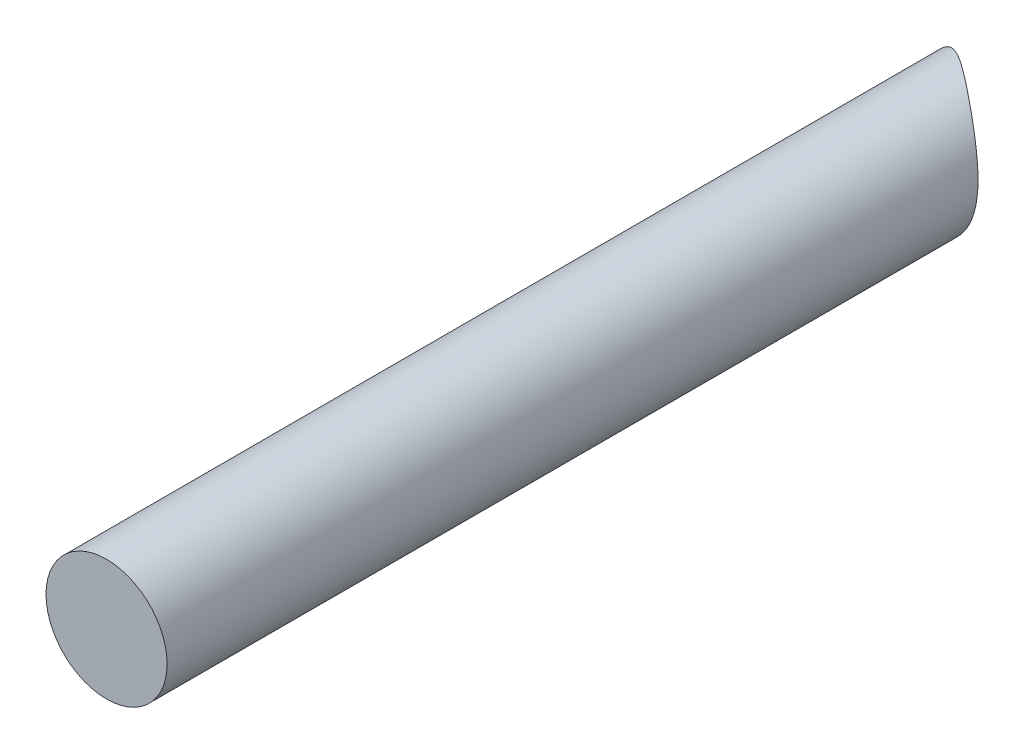
ISO-10303-21;
HEADER;
FILE_DESCRIPTION(('STEP AP214'),'2;1');
FILE_NAME('part.step','',(''),(''),'','','');
FILE_SCHEMA(('AUTOMOTIVE_DESIGN { 1 0 10303 214 1 1 1 1 }'));
ENDSEC;
DATA;
#1=APPLICATION_CONTEXT('core data for automotive mechanical design processes');
#2=APPLICATION_PROTOCOL_DEFINITION('international standard','automotive_design',2000,#1);
#3=PRODUCT_CONTEXT('',#1,'mechanical');
#4=PRODUCT('Part','Part','',(#3));
#5=PRODUCT_RELATED_PRODUCT_CATEGORY('part','',(#4));
#6=PRODUCT_DEFINITION_FORMATION('','',#4);
#7=PRODUCT_DEFINITION_CONTEXT('part definition',#1,'design');
#8=PRODUCT_DEFINITION('design','',#6,#7);
#9=PRODUCT_DEFINITION_SHAPE('','',#8);
#10=(LENGTH_UNIT() NAMED_UNIT(*) SI_UNIT(.MILLI.,.METRE.));
#11=(NAMED_UNIT(*) PLANE_ANGLE_UNIT() SI_UNIT($,.RADIAN.));
#12=(NAMED_UNIT(*) SI_UNIT($,.STERADIAN.) SOLID_ANGLE_UNIT());
#13=UNCERTAINTY_MEASURE_WITH_UNIT(LENGTH_MEASURE(1.E-05),#10,'distance_accuracy_value','');
#14=(GEOMETRIC_REPRESENTATION_CONTEXT(3) GLOBAL_UNCERTAINTY_ASSIGNED_CONTEXT((#13)) GLOBAL_UNIT_ASSIGNED_CONTEXT((#10,
#11,#12)) REPRESENTATION_CONTEXT('',''));
#15=CARTESIAN_POINT('',(0.,0.,0.));
#16=DIRECTION('',(0.,0.,1.));
#17=DIRECTION('',(1.,0.,0.));
#18=AXIS2_PLACEMENT_3D('',#15,#16,#17);
#19=CARTESIAN_POINT('',(1555.51652372475,3110.0999566984,2735.35024862903));
#20=DIRECTION('',(-0.697557301181384,-0.716463299499802,-0.00970319732880674));
#21=DIRECTION('',(-0.71649703012172,0.697590141721309,0.));
#22=AXIS2_PLACEMENT_3D('',#19,#20,#21);
#23=CYLINDRICAL_SURFACE('',#22,26.5909028096916);
#24=CARTESIAN_POINT('',(1536.53405872076,3098.165708914,2761.20230506653));
#25=CARTESIAN_POINT('',(1536.79489555822,3098.16570099659,2761.24190647931));
#26=CARTESIAN_POINT('',(1537.05618088354,3098.1764273707,2761.27803803388));
#27=CARTESIAN_POINT('',(1537.57783423331,3098.21945742673,2761.34410445853));
#28=CARTESIAN_POINT('',(1537.83820211725,3098.25176428079,2761.37403841676));
#29=CARTESIAN_POINT('',(1538.35609401425,3098.33791315794,2761.42844538035));
#30=CARTESIAN_POINT('',(1538.61361602915,3098.39176943263,2761.45291475501));
#31=CARTESIAN_POINT('',(1539.12370666727,3098.52072795353,2761.49710782214));
#32=CARTESIAN_POINT('',(1539.37627517071,3098.59583071286,2761.51683139998));
#33=CARTESIAN_POINT('',(1539.87435170546,3098.76673373495,2761.55221810646));
#34=CARTESIAN_POINT('',(1540.11986569697,3098.86251590653,2761.56788475807));
#35=CARTESIAN_POINT('',(1540.6022737529,3099.07417644081,2761.59581466201));
#36=CARTESIAN_POINT('',(1540.83916775527,3099.19005494816,2761.60807788985));
#37=CARTESIAN_POINT('',(1541.30260827622,3099.44110258951,2761.62974104923));
#38=CARTESIAN_POINT('',(1541.52915583247,3099.57626978336,2761.63914126846));
#39=CARTESIAN_POINT('',(1541.97031722695,3099.86496862367,2761.6555064526));
#40=CARTESIAN_POINT('',(1542.18493124159,3100.01849999856,2761.66247145352));
#41=CARTESIAN_POINT('',(1542.6023803216,3100.34416310231,2761.67430867408));
#42=CARTESIAN_POINT('',(1542.80510771741,3100.5164334923,2761.67916374882));
#43=CARTESIAN_POINT('',(1543.19546729797,3100.87734546775,2761.68685502591));
#44=CARTESIAN_POINT('',(1543.38309939527,3101.06598714803,2761.68969121657));
#45=CARTESIAN_POINT('',(1543.74194732102,3101.45832216507,2761.69334591514));
#46=CARTESIAN_POINT('',(1543.91316236863,3101.66201621696,2761.69416432711));
#47=CARTESIAN_POINT('',(1544.23795474933,3102.08300952585,2761.69362951165));
#48=CARTESIAN_POINT('',(1544.39153207297,3102.30030879014,2761.69227628304));
#49=CARTESIAN_POINT('',(1544.68039457656,3102.74763955949,2761.68708681065));
#50=CARTESIAN_POINT('',(1544.81562366482,3102.97770720624,2761.6832431515));
#51=CARTESIAN_POINT('',(1545.06628408457,3103.44832366848,2761.67261840869));
#52=CARTESIAN_POINT('',(1545.18171534057,3103.68887252393,2761.66583731383));
#53=CARTESIAN_POINT('',(1545.39196169592,3104.17869920059,2761.64876540084));
#54=CARTESIAN_POINT('',(1545.48677680021,3104.42797701971,2761.63847458354));
#55=CARTESIAN_POINT('',(1545.65512847194,3104.93341643516,2761.61370789531));
#56=CARTESIAN_POINT('',(1545.72866520212,3105.18957797883,2761.59923205637));
#57=CARTESIAN_POINT('',(1545.85357010681,3105.70519940292,2761.56545265287));
#58=CARTESIAN_POINT('',(1545.90507696466,3105.96462773841,2761.54618053539));
#59=CARTESIAN_POINT('',(1545.98630573226,3106.48640016244,2761.5019841689));
#60=CARTESIAN_POINT('',(1546.01602773458,3106.74874423858,2761.47705994392));
#61=CARTESIAN_POINT('',(1546.05359539449,3107.27426216104,2761.42077987514));
#62=CARTESIAN_POINT('',(1546.06144499652,3107.53743584917,2761.3894251921));
#63=CARTESIAN_POINT('',(1546.05541823418,3108.06257717398,2761.31953114915));
#64=CARTESIAN_POINT('',(1546.041542234,3108.32454483081,2761.2809919097));
#65=CARTESIAN_POINT('',(1545.99289082841,3108.84051915432,2761.1968144769));
#66=CARTESIAN_POINT('',(1545.95849419956,3109.09458437032,2761.1513157948));
#67=CARTESIAN_POINT('',(1545.86972490332,3109.59758649225,2761.05220390093));
#68=CARTESIAN_POINT('',(1545.81535256037,3109.8465234814,2760.99859082097));
#69=CARTESIAN_POINT('',(1545.68748079168,3110.33736759472,2760.88285953821));
#70=CARTESIAN_POINT('',(1545.61398395902,3110.57927566699,2760.82074248901));
#71=CARTESIAN_POINT('',(1545.44891892458,3111.0543575199,2760.68775722782));
#72=CARTESIAN_POINT('',(1545.35735066276,3111.28753127152,2760.61688898675));
#73=CARTESIAN_POINT('',(1545.15774496721,3111.74277228182,2760.466596879));
#74=CARTESIAN_POINT('',(1545.04976690702,3111.96487589411,2760.38720414772));
#75=CARTESIAN_POINT('',(1544.81848515283,3112.39752054461,2760.21975530532));
#76=CARTESIAN_POINT('',(1544.69518157772,3112.60806167249,2760.1316992614));
#77=CARTESIAN_POINT('',(1544.43469897238,3113.01651318086,2759.94716042849));
#78=CARTESIAN_POINT('',(1544.29751815683,3113.21442193083,2759.85067655546));
#79=CARTESIAN_POINT('',(1544.01078662331,3113.59674610825,2759.64966635408));
#80=CARTESIAN_POINT('',(1543.86123457736,3113.78116008309,2759.54513916239));
#81=CARTESIAN_POINT('',(1543.54166428316,3114.14684110589,2759.32183451228));
#82=CARTESIAN_POINT('',(1543.37095224631,3114.32720734407,2759.20257549946));
#83=CARTESIAN_POINT('',(1543.01898264581,3114.67154061192,2758.95623860412));
#84=CARTESIAN_POINT('',(1542.83772471839,3114.83550707537,2758.8291604519));
#85=CARTESIAN_POINT('',(1542.46622569904,3115.14683166156,2758.56792479968));
#86=CARTESIAN_POINT('',(1542.27598308339,3115.29418695274,2758.43376609843));
#87=CARTESIAN_POINT('',(1541.88797216188,3115.57221984642,2758.15918344369));
#88=CARTESIAN_POINT('',(1541.69020298721,3115.70289551597,2758.01875876659));
#89=CARTESIAN_POINT('',(1541.25945989144,3115.96528717634,2757.71183524189));
#90=CARTESIAN_POINT('',(1541.02552079031,3116.09443763194,2757.54449578067));
#91=CARTESIAN_POINT('',(1540.55113022041,3116.33125655223,2757.203965184));
#92=CARTESIAN_POINT('',(1540.31067818521,3116.43892314158,2757.03077353926));
#93=CARTESIAN_POINT('',(1539.8244026833,3116.63318511928,2756.67964978706));
#94=CARTESIAN_POINT('',(1539.57857423603,3116.71975998239,2756.50171324745));
#95=CARTESIAN_POINT('',(1539.08287391571,3116.87201620478,2756.14255907646));
#96=CARTESIAN_POINT('',(1538.83300169093,3116.93769573623,2755.96134115951));
#97=CARTESIAN_POINT('',(1538.28413842867,3117.05850477718,2755.56367961011));
#98=CARTESIAN_POINT('',(1537.98451419737,3117.10951425205,2755.34684935279));
#99=CARTESIAN_POINT('',(1537.38189744994,3117.18275611516,2754.91287738251));
#100=CARTESIAN_POINT('',(1537.07890413575,3117.20498153204,2754.69573560685));
#101=CARTESIAN_POINT('',(1536.47044757043,3117.2203569422,2754.26399467879));
#102=CARTESIAN_POINT('',(1536.16498477562,3117.2135121899,2754.04939507393));
#103=CARTESIAN_POINT('',(1535.55218643626,3117.16994353692,2753.62608378887));
#104=CARTESIAN_POINT('',(1535.2448516802,3117.1332314551,2753.41736981346));
#105=CARTESIAN_POINT('',(1534.72688404803,3117.04512341948,2753.07492121329));
#106=CARTESIAN_POINT('',(1534.51660394275,3117.00211905036,2752.93846379901));
#107=CARTESIAN_POINT('',(1534.09561118653,3116.90083852421,2752.67196919343));
#108=CARTESIAN_POINT('',(1533.88489854186,3116.84256258723,2752.54193190966));
#109=CARTESIAN_POINT('',(1533.46369091676,3116.70997242829,2752.29055311075));
#110=CARTESIAN_POINT('',(1533.25319605377,3116.63568116847,2752.16919947373));
#111=CARTESIAN_POINT('',(1532.83288047884,3116.47011548391,2751.93763111689));
#112=CARTESIAN_POINT('',(1532.6230595817,3116.37884621961,2751.8274130281));
#113=CARTESIAN_POINT('',(1532.10673809094,3116.13110197603,2751.57273598015));
#114=CARTESIAN_POINT('',(1531.80097594716,3115.96410671328,2751.43641256003));
#115=CARTESIAN_POINT('',(1531.34954569292,3115.6830756609,2751.26382368674));
#116=CARTESIAN_POINT('',(1531.20028600886,3115.58432061963,2751.21161381703));
#117=CARTESIAN_POINT('',(1530.90517173249,3115.37665408118,2751.11928785792));
#118=CARTESIAN_POINT('',(1530.75931532566,3115.26774815835,2751.07916518149));
#119=CARTESIAN_POINT('',(1530.4706395484,3115.03883000977,2751.01197605436));
#120=CARTESIAN_POINT('',(1530.32787231008,3114.91870730081,2750.9850604701));
#121=CARTESIAN_POINT('',(1530.04855137881,3114.669167147,2750.94600154237));
#122=CARTESIAN_POINT('',(1529.91199750731,3114.5397499695,2750.9338577742));
#123=CARTESIAN_POINT('',(1529.64660702707,3114.2728093221,2750.92483627034));
#124=CARTESIAN_POINT('',(1529.51776794306,3114.13528848063,2750.92795361132));
#125=CARTESIAN_POINT('',(1529.2690279004,3113.85352215528,2750.94928482999));
#126=CARTESIAN_POINT('',(1529.14912644509,3113.70927704578,2750.96749786813));
#127=CARTESIAN_POINT('',(1528.93595692683,3113.4370004998,2751.01453624689));
#128=CARTESIAN_POINT('',(1528.84135433858,3113.30967080374,2751.0414275275));
#129=CARTESIAN_POINT('',(1528.65965552569,3113.05207769774,2751.10489096671));
#130=CARTESIAN_POINT('',(1528.5725619092,3112.92181328812,2751.14146647119));
#131=CARTESIAN_POINT('',(1528.32280143141,3112.52779943155,2751.26440488046));
#132=CARTESIAN_POINT('',(1528.17160459719,3112.260764503,2751.3639916046));
#133=CARTESIAN_POINT('',(1527.92865260614,3111.7808060611,2751.56621552348));
#134=CARTESIAN_POINT('',(1527.83109850221,3111.56850133495,2751.66366241979));
#135=CARTESIAN_POINT('',(1527.65370644121,3111.14296571199,2751.87201601047));
#136=CARTESIAN_POINT('',(1527.573877477,3110.92973440075,2751.98292949317));
#137=CARTESIAN_POINT('',(1527.43085739128,3110.50285773498,2752.21547853457));
#138=CARTESIAN_POINT('',(1527.36770919162,3110.28921271024,2752.3371406992));
#139=CARTESIAN_POINT('',(1527.25736137147,3109.86258475065,2752.58847236666));
#140=CARTESIAN_POINT('',(1527.21016133653,3109.64960179875,2752.71814166131));
#141=CARTESIAN_POINT('',(1527.11229619949,3109.12490411511,2753.0457151235));
#142=CARTESIAN_POINT('',(1527.07038203578,3108.81371698991,2753.24710725429));
#143=CARTESIAN_POINT('',(1527.01727800314,3108.19396552333,2753.65790003332));
#144=CARTESIAN_POINT('',(1527.006101716,3107.8854024014,2753.86730418032));
#145=CARTESIAN_POINT('',(1527.01334082754,3107.27132754863,2754.29043441085));
#146=CARTESIAN_POINT('',(1527.03177572812,3106.96581796222,2754.50416325108));
#147=CARTESIAN_POINT('',(1527.09770032018,3106.35881543694,2754.93272075138));
#148=CARTESIAN_POINT('',(1527.14518570728,3106.05732190979,2755.14754924386));
#149=CARTESIAN_POINT('',(1527.2703933197,3105.45300418145,2755.58025301093));
#150=CARTESIAN_POINT('',(1527.34872874847,3105.15028466238,2755.79809770382));
#151=CARTESIAN_POINT('',(1527.5357895088,3104.55141303995,2756.22984162092));
#152=CARTESIAN_POINT('',(1527.64451776663,3104.25526157196,2756.4437404631));
#153=CARTESIAN_POINT('',(1527.89258658123,3103.67189035498,2756.86497489414));
#154=CARTESIAN_POINT('',(1528.03188401409,3103.38465866802,2757.07231926265));
#155=CARTESIAN_POINT('',(1528.34158218525,3102.8211872469,2757.47851612024));
#156=CARTESIAN_POINT('',(1528.51197520086,3102.54494480424,2757.67737070269));
#157=CARTESIAN_POINT('',(1528.84740325312,3102.05954512786,2758.02629729225));
#158=CARTESIAN_POINT('',(1529.00687848373,3101.84789452157,2758.17826090081));
#159=CARTESIAN_POINT('',(1529.34595363687,3101.43547065585,2758.47425698213));
#160=CARTESIAN_POINT('',(1529.52554964804,3101.23469529356,2758.61829098826));
#161=CARTESIAN_POINT('',(1529.90456938612,3100.84606467693,2758.89741508625));
#162=CARTESIAN_POINT('',(1530.10399111616,3100.6582081246,2759.03250607659));
#163=CARTESIAN_POINT('',(1530.5220628907,3100.29762280065,2759.29283868252));
#164=CARTESIAN_POINT('',(1530.74071305405,3100.12489412254,2759.41808023722));
#165=CARTESIAN_POINT('',(1531.19778806926,3099.79579461288,2759.65874906343));
#166=CARTESIAN_POINT('',(1531.43633749687,3099.63954324476,2759.77410365697));
#167=CARTESIAN_POINT('',(1531.9304428561,3099.34716328067,2759.9934465413));
#168=CARTESIAN_POINT('',(1532.18599985569,3099.21103595012,2760.09743411721));
#169=CARTESIAN_POINT('',(1532.71188113685,3098.96138026415,2760.29358670872));
#170=CARTESIAN_POINT('',(1532.98218833642,3098.84782644602,2760.38576500284));
#171=CARTESIAN_POINT('',(1533.53533057896,3098.64526672792,2760.55836048539));
#172=CARTESIAN_POINT('',(1533.81816165648,3098.55625312139,2760.63878136236));
#173=CARTESIAN_POINT('',(1534.497413532,3098.37720520709,2760.81505841035));
#174=CARTESIAN_POINT('',(1534.89810077489,3098.29831925039,2760.90606244883));
#175=CARTESIAN_POINT('',(1535.71017195593,3098.19258074413,2761.06837038176));
#176=CARTESIAN_POINT('',(1536.12155449749,3098.16572143511,2761.13967683433));
#177=CARTESIAN_POINT('',(1536.53405872076,3098.165708914,2761.20230506653));
#178=B_SPLINE_CURVE_WITH_KNOTS('',3,(#24,#25,#26,#27,#28,#29,#30,#31,#32,#33,#34,#35,#36,#37,
#38,#39,#40,#41,#42,#43,#44,#45,#46,#47,#48,#49,#50,#51,#52,#53,#54,#55,#56,#57,#58,#59,#60,#61,
#62,#63,#64,#65,#66,#67,#68,#69,#70,#71,#72,#73,#74,#75,#76,#77,#78,#79,#80,#81,#82,#83,#84,#85,
#86,#87,#88,#89,#90,#91,#92,#93,#94,#95,#96,#97,#98,#99,#100,#101,#102,#103,#104,#105,#106,#107,
#108,#109,#110,#111,#112,#113,#114,#115,#116,#117,#118,#119,#120,#121,#122,#123,#124,#125,#126,
#127,#128,#129,#130,#131,#132,#133,#134,#135,#136,#137,#138,#139,#140,#141,#142,#143,#144,#145,
#146,#147,#148,#149,#150,#151,#152,#153,#154,#155,#156,#157,#158,#159,#160,#161,#162,#163,#164,
#165,#166,#167,#168,#169,#170,#171,#172,#173,#174,#175,#176,#177),.UNSPECIFIED.,.T.,.F.,(4,2,2,
2,2,2,2,2,2,2,2,2,2,2,2,2,2,2,2,2,2,2,2,2,2,2,2,2,2,2,2,2,2,2,2,2,2,2,2,2,2,2,2,2,2,2,2,2,2,2,2,
2,2,2,2,2,2,2,2,2,2,2,2,2,2,2,2,2,2,2,2,2,2,2,2,2,4),(0.,0.791105119477076,1.58232654959947,
2.37407211687244,3.16583680665358,3.95691161560461,4.74799211868591,5.53899310790185,
6.32998240208272,7.1272841467414,7.92459050980913,8.72193477598824,9.51927946928041,
10.3190092679613,11.1187421162121,11.9184747731136,12.7182013134135,13.5128165112473,
14.3074283323721,15.101896845245,15.8963520403785,16.6765779027762,17.4567910934423,
18.2368985503868,19.0170085997236,19.7943604696803,20.571706309714,21.349152283348,
22.1266818201926,22.9523228502097,23.7779923760358,24.6038024341256,25.4297081063435,
26.3746716595126,27.3197176633707,28.2656796898779,29.2117244420492,30.3306173070443,
31.4497811119759,32.5687426370216,33.6872615912088,34.4498080569852,35.2123435359025,
35.9737929074535,36.7350112140773,37.8526989264026,38.4114284272705,38.9698528897369,
39.5345158475437,40.0991625700366,40.6636271458433,41.2280603311888,41.710212625446,
42.1925317199985,43.1569235636834,43.9154254514736,44.674311290534,45.435131231928,
46.1959313999754,47.3134328800673,48.4314280581949,49.5501598493296,50.6687259196185,
51.8107490421546,52.9528821586667,54.0934143099899,55.2336635911213,56.1492367884529,
57.0646323115486,57.9799357273044,58.8952448012291,59.8167898696816,60.7383928612757,
61.6589503197017,62.5792183575818,63.8304856735784,65.081590410244),.UNSPECIFIED.);
#179=CARTESIAN_POINT('',(1536.53405872076,3098.165708914,2761.20230506653));
#180=VERTEX_POINT('',#179);
#181=EDGE_CURVE('E10',#180,#180,#178,.T.);
#182=ORIENTED_EDGE('',*,*,#181,.F.);
#183=EDGE_LOOP('',(#182));
#184=FACE_BOUND('',#183,.T.);
#185=ADVANCED_FACE('F35',(#184),#23,.F.);
#186=CARTESIAN_POINT('',(1536.53405872076,3107.690708914,2888.79950900504));
#187=DIRECTION('',(0.,0.,1.));
#188=DIRECTION('',(0.,1.,0.));
#189=AXIS2_PLACEMENT_3D('',#186,#187,#188);
#190=PLANE('',#189);
#191=CARTESIAN_POINT('',(1536.53405872076,3107.690708914,2888.79950900504));
#192=DIRECTION('',(0.,0.,1.));
#193=DIRECTION('',(0.,1.,0.));
#194=AXIS2_PLACEMENT_3D('',#191,#192,#193);
#195=CIRCLE('',#194,9.52500000000001);
#196=CARTESIAN_POINT('',(1536.53405872076,3117.215708914,2888.79950900504));
#197=VERTEX_POINT('',#196);
#198=EDGE_CURVE('E46',#197,#197,#195,.T.);
#199=ORIENTED_EDGE('',*,*,#198,.T.);
#200=EDGE_LOOP('',(#199));
#201=FACE_BOUND('',#200,.T.);
#202=ADVANCED_FACE('F52',(#201),#190,.T.);
#203=CARTESIAN_POINT('',(1536.53405872076,3107.690708914,2888.79950900504));
#204=DIRECTION('',(0.,0.,-1.));
#205=DIRECTION('',(0.,-1.,0.));
#206=AXIS2_PLACEMENT_3D('',#203,#204,#205);
#207=CYLINDRICAL_SURFACE('',#206,9.52500000000001);
#208=ORIENTED_EDGE('',*,*,#181,.T.);
#209=EDGE_LOOP('',(#208));
#210=FACE_BOUND('',#209,.T.);
#211=ORIENTED_EDGE('',*,*,#198,.F.);
#212=EDGE_LOOP('',(#211));
#213=FACE_BOUND('',#212,.T.);
#214=ADVANCED_FACE('F54',(#210,#213),#207,.T.);
#215=CLOSED_SHELL('',(#185,#202,#214));
#216=MANIFOLD_SOLID_BREP('B2',#215);
#217=ADVANCED_BREP_SHAPE_REPRESENTATION('',(#18,#216),#14);
#218=SHAPE_DEFINITION_REPRESENTATION(#9,#217);
ENDSEC;
END-ISO-10303-21;
